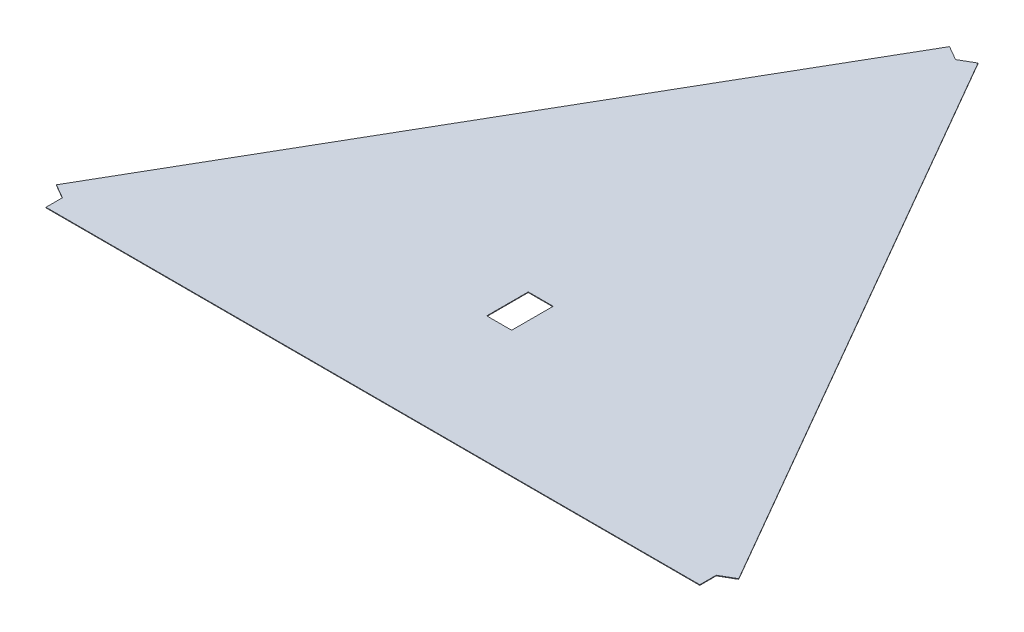
ISO-10303-21;
HEADER;
FILE_DESCRIPTION(('STEP AP214'),'2;1');
FILE_NAME('part.step','',(''),(''),'','','');
FILE_SCHEMA(('AUTOMOTIVE_DESIGN { 1 0 10303 214 1 1 1 1 }'));
ENDSEC;
DATA;
#1=APPLICATION_CONTEXT('core data for automotive mechanical design processes');
#2=APPLICATION_PROTOCOL_DEFINITION('international standard','automotive_design',2000,#1);
#3=PRODUCT_CONTEXT('',#1,'mechanical');
#4=PRODUCT('Part','Part','',(#3));
#5=PRODUCT_RELATED_PRODUCT_CATEGORY('part','',(#4));
#6=PRODUCT_DEFINITION_FORMATION('','',#4);
#7=PRODUCT_DEFINITION_CONTEXT('part definition',#1,'design');
#8=PRODUCT_DEFINITION('design','',#6,#7);
#9=PRODUCT_DEFINITION_SHAPE('','',#8);
#10=(LENGTH_UNIT() NAMED_UNIT(*) SI_UNIT(.MILLI.,.METRE.));
#11=(NAMED_UNIT(*) PLANE_ANGLE_UNIT() SI_UNIT($,.RADIAN.));
#12=(NAMED_UNIT(*) SI_UNIT($,.STERADIAN.) SOLID_ANGLE_UNIT());
#13=UNCERTAINTY_MEASURE_WITH_UNIT(LENGTH_MEASURE(1.E-05),#10,'distance_accuracy_value','');
#14=(GEOMETRIC_REPRESENTATION_CONTEXT(3) GLOBAL_UNCERTAINTY_ASSIGNED_CONTEXT((#13)) GLOBAL_UNIT_ASSIGNED_CONTEXT((#10,
#11,#12)) REPRESENTATION_CONTEXT('',''));
#15=CARTESIAN_POINT('',(0.,0.,0.));
#16=DIRECTION('',(0.,0.,1.));
#17=DIRECTION('',(1.,0.,0.));
#18=AXIS2_PLACEMENT_3D('',#15,#16,#17);
#19=CARTESIAN_POINT('',(3.08472954151232E-10,30035.2576446533,65120.5631891889));
#20=DIRECTION('',(0.,0.,-1.));
#21=DIRECTION('',(-1.,0.,0.));
#22=AXIS2_PLACEMENT_3D('',#19,#20,#21);
#23=PLANE('',#22);
#24=DIRECTION('',(1.,0.,0.));
#25=VECTOR('',#24,1.);
#26=CARTESIAN_POINT('',(3.08472954151232E-10,29965.2576446533,65120.5631891889));
#27=LINE('',#26,#25);
#28=CARTESIAN_POINT('',(47009.1129449273,29965.2576446533,65120.5631891887));
#29=VERTEX_POINT('',#28);
#30=CARTESIAN_POINT('',(50009.1129449273,29965.2576446533,65120.5631891887));
#31=VERTEX_POINT('',#30);
#32=EDGE_CURVE('E189',#29,#31,#27,.T.);
#33=ORIENTED_EDGE('',*,*,#32,.F.);
#34=DIRECTION('',(0.,-1.,0.));
#35=VECTOR('',#34,1.);
#36=CARTESIAN_POINT('',(47009.1129449273,30035.2576446533,65120.5631891887));
#37=LINE('',#36,#35);
#38=CARTESIAN_POINT('',(47009.1129449273,30035.2576446533,65120.5631891887));
#39=VERTEX_POINT('',#38);
#40=EDGE_CURVE('E11',#39,#29,#37,.T.);
#41=ORIENTED_EDGE('',*,*,#40,.F.);
#42=DIRECTION('',(1.,0.,0.));
#43=VECTOR('',#42,1.);
#44=CARTESIAN_POINT('',(3.08472954151232E-10,30035.2576446533,65120.5631891889));
#45=LINE('',#44,#43);
#46=CARTESIAN_POINT('',(50009.1129449273,30035.2576446533,65120.5631891887));
#47=VERTEX_POINT('',#46);
#48=EDGE_CURVE('E150',#39,#47,#45,.T.);
#49=ORIENTED_EDGE('',*,*,#48,.T.);
#50=DIRECTION('',(0.,-1.,0.));
#51=VECTOR('',#50,1.);
#52=CARTESIAN_POINT('',(50009.1129449273,30035.2576446533,65120.5631891887));
#53=LINE('',#52,#51);
#54=EDGE_CURVE('E54',#47,#31,#53,.T.);
#55=ORIENTED_EDGE('',*,*,#54,.T.);
#56=EDGE_LOOP('',(#33,#41,#49,#55));
#57=FACE_BOUND('',#56,.T.);
#58=ADVANCED_FACE('F35',(#57),#23,.T.);
#59=CARTESIAN_POINT('',(47009.1129449273,30035.2576446533,0.));
#60=DIRECTION('',(-1.,0.,0.));
#61=DIRECTION('',(0.,0.,1.));
#62=AXIS2_PLACEMENT_3D('',#59,#60,#61);
#63=PLANE('',#62);
#64=DIRECTION('',(0.,0.,-1.));
#65=VECTOR('',#64,1.);
#66=CARTESIAN_POINT('',(47009.1129449273,29965.2576446533,0.));
#67=LINE('',#66,#65);
#68=CARTESIAN_POINT('',(47009.1129449273,29965.2576446533,60120.5631891887));
#69=VERTEX_POINT('',#68);
#70=EDGE_CURVE('E155',#29,#69,#67,.T.);
#71=ORIENTED_EDGE('',*,*,#70,.T.);
#72=DIRECTION('',(0.,-1.,0.));
#73=VECTOR('',#72,1.);
#74=CARTESIAN_POINT('',(47009.1129449273,30035.2576446533,60120.5631891887));
#75=LINE('',#74,#73);
#76=CARTESIAN_POINT('',(47009.1129449273,30035.2576446533,60120.5631891887));
#77=VERTEX_POINT('',#76);
#78=EDGE_CURVE('E45',#77,#69,#75,.T.);
#79=ORIENTED_EDGE('',*,*,#78,.F.);
#80=DIRECTION('',(0.,0.,-1.));
#81=VECTOR('',#80,1.);
#82=CARTESIAN_POINT('',(47009.1129449273,30035.2576446533,0.));
#83=LINE('',#82,#81);
#84=EDGE_CURVE('E145',#39,#77,#83,.T.);
#85=ORIENTED_EDGE('',*,*,#84,.F.);
#86=ORIENTED_EDGE('',*,*,#40,.T.);
#87=EDGE_LOOP('',(#71,#79,#85,#86));
#88=FACE_BOUND('',#87,.T.);
#89=ADVANCED_FACE('F153',(#88),#63,.F.);
#90=CARTESIAN_POINT('',(0.,30035.2576446533,60120.5631891887));
#91=DIRECTION('',(0.,0.,-1.));
#92=DIRECTION('',(-1.,0.,0.));
#93=AXIS2_PLACEMENT_3D('',#90,#91,#92);
#94=PLANE('',#93);
#95=DIRECTION('',(1.,0.,0.));
#96=VECTOR('',#95,1.);
#97=CARTESIAN_POINT('',(0.,29965.2576446533,60120.5631891887));
#98=LINE('',#97,#96);
#99=CARTESIAN_POINT('',(50009.1129449273,29965.2576446533,60120.5631891887));
#100=VERTEX_POINT('',#99);
#101=EDGE_CURVE('E186',#69,#100,#98,.T.);
#102=ORIENTED_EDGE('',*,*,#101,.T.);
#103=DIRECTION('',(0.,-1.,0.));
#104=VECTOR('',#103,1.);
#105=CARTESIAN_POINT('',(50009.1129449273,30035.2576446533,60120.5631891887));
#106=LINE('',#105,#104);
#107=CARTESIAN_POINT('',(50009.1129449273,30035.2576446533,60120.5631891887));
#108=VERTEX_POINT('',#107);
#109=EDGE_CURVE('E95',#108,#100,#106,.T.);
#110=ORIENTED_EDGE('',*,*,#109,.F.);
#111=DIRECTION('',(1.,0.,0.));
#112=VECTOR('',#111,1.);
#113=CARTESIAN_POINT('',(0.,30035.2576446533,60120.5631891887));
#114=LINE('',#113,#112);
#115=EDGE_CURVE('E137',#77,#108,#114,.T.);
#116=ORIENTED_EDGE('',*,*,#115,.F.);
#117=ORIENTED_EDGE('',*,*,#78,.T.);
#118=EDGE_LOOP('',(#102,#110,#116,#117));
#119=FACE_BOUND('',#118,.T.);
#120=ADVANCED_FACE('F139',(#119),#94,.F.);
#121=CARTESIAN_POINT('',(16526.6845081917,30035.2576446533,28625.060606751));
#122=DIRECTION('',(-0.499999956010115,0.,-0.866025429182009));
#123=DIRECTION('',(-0.866025429182009,0.,0.499999956010115));
#124=AXIS2_PLACEMENT_3D('',#121,#122,#123);
#125=PLANE('',#124);
#126=DIRECTION('',(0.866025429182009,0.,-0.499999956010115));
#127=VECTOR('',#126,1.);
#128=CARTESIAN_POINT('',(16526.6845081917,29965.2576446533,28625.060606751));
#129=LINE('',#128,#127);
#130=CARTESIAN_POINT('',(48509.1133117676,29965.2576446533,10159.9988937378));
#131=VERTEX_POINT('',#130);
#132=CARTESIAN_POINT('',(50223.843661548,29965.2576446533,9169.99898083775));
#133=VERTEX_POINT('',#132);
#134=EDGE_CURVE('E214',#131,#133,#129,.T.);
#135=ORIENTED_EDGE('',*,*,#134,.F.);
#136=DIRECTION('',(0.,-1.,0.));
#137=VECTOR('',#136,1.);
#138=CARTESIAN_POINT('',(48509.1133117676,30035.2576446533,10159.9988937378));
#139=LINE('',#138,#137);
#140=CARTESIAN_POINT('',(48509.1133117676,30035.2576446533,10159.9988937378));
#141=VERTEX_POINT('',#140);
#142=EDGE_CURVE('E39',#141,#131,#139,.T.);
#143=ORIENTED_EDGE('',*,*,#142,.F.);
#144=DIRECTION('',(0.866025429182009,0.,-0.499999956010115));
#145=VECTOR('',#144,1.);
#146=CARTESIAN_POINT('',(16526.6845081917,30035.2576446533,28625.060606751));
#147=LINE('',#146,#145);
#148=CARTESIAN_POINT('',(50223.843661548,30035.2576446533,9169.99898083775));
#149=VERTEX_POINT('',#148);
#150=EDGE_CURVE('E185',#141,#149,#147,.T.);
#151=ORIENTED_EDGE('',*,*,#150,.T.);
#152=DIRECTION('',(0.,-1.,0.));
#153=VECTOR('',#152,1.);
#154=CARTESIAN_POINT('',(50223.843661548,30035.2576446533,9169.99898083775));
#155=LINE('',#154,#153);
#156=EDGE_CURVE('E160',#149,#133,#155,.T.);
#157=ORIENTED_EDGE('',*,*,#156,.T.);
#158=EDGE_LOOP('',(#135,#143,#151,#157));
#159=FACE_BOUND('',#158,.T.);
#160=ADVANCED_FACE('F37',(#159),#125,.T.);
#161=CARTESIAN_POINT('',(7727.8682672328,30035.2576446533,-13385.0617189679));
#162=DIRECTION('',(-0.499999965093882,0.,0.866025423937494));
#163=DIRECTION('',(0.866025423937495,0.,0.499999965093882));
#164=AXIS2_PLACEMENT_3D('',#161,#162,#163);
#165=PLANE('',#164);
#166=DIRECTION('',(-0.866025423937495,0.,-0.499999965093882));
#167=VECTOR('',#166,1.);
#168=CARTESIAN_POINT('',(7727.8682672328,29965.2576446533,-13385.0617189679));
#169=LINE('',#168,#167);
#170=CARTESIAN_POINT('',(46794.3829723713,29965.2576446533,9169.99896285191));
#171=VERTEX_POINT('',#170);
#172=EDGE_CURVE('E212',#131,#171,#169,.T.);
#173=ORIENTED_EDGE('',*,*,#172,.T.);
#174=DIRECTION('',(0.,-1.,0.));
#175=VECTOR('',#174,1.);
#176=CARTESIAN_POINT('',(46794.3829723713,30035.2576446533,9169.99896285191));
#177=LINE('',#176,#175);
#178=CARTESIAN_POINT('',(46794.3829723713,30035.2576446533,9169.99896285191));
#179=VERTEX_POINT('',#178);
#180=EDGE_CURVE('E173',#179,#171,#177,.T.);
#181=ORIENTED_EDGE('',*,*,#180,.F.);
#182=DIRECTION('',(-0.866025423937495,0.,-0.499999965093882));
#183=VECTOR('',#182,1.);
#184=CARTESIAN_POINT('',(7727.8682672328,30035.2576446533,-13385.0617189679));
#185=LINE('',#184,#183);
#186=EDGE_CURVE('E237',#141,#179,#185,.T.);
#187=ORIENTED_EDGE('',*,*,#186,.F.);
#188=ORIENTED_EDGE('',*,*,#142,.T.);
#189=EDGE_LOOP('',(#173,#181,#187,#188));
#190=FACE_BOUND('',#189,.T.);
#191=ADVANCED_FACE('F253',(#190),#165,.F.);
#192=CARTESIAN_POINT('',(39066.5147051385,30035.2576446533,22555.0606818198));
#193=DIRECTION('',(-0.866025423937494,0.,-0.499999965093882));
#194=DIRECTION('',(-0.499999965093882,0.,0.866025423937494));
#195=AXIS2_PLACEMENT_3D('',#192,#193,#194);
#196=PLANE('',#195);
#197=DIRECTION('',(0.499999965093882,0.,-0.866025423937494));
#198=VECTOR('',#197,1.);
#199=CARTESIAN_POINT('',(39066.5147051385,29965.2576446533,22555.0606818198));
#200=LINE('',#199,#198);
#201=CARTESIAN_POINT('',(7424.38308681225,29965.2576446533,77360.8454060282));
#202=VERTEX_POINT('',#201);
#203=EDGE_CURVE('E209',#202,#171,#200,.T.);
#204=ORIENTED_EDGE('',*,*,#203,.F.);
#205=DIRECTION('',(0.,-1.,0.));
#206=VECTOR('',#205,1.);
#207=CARTESIAN_POINT('',(7424.38308681225,30035.2576446533,77360.8454060282));
#208=LINE('',#207,#206);
#209=CARTESIAN_POINT('',(7424.38308681225,30035.2576446533,77360.8454060282));
#210=VERTEX_POINT('',#209);
#211=EDGE_CURVE('E172',#210,#202,#208,.T.);
#212=ORIENTED_EDGE('',*,*,#211,.F.);
#213=DIRECTION('',(0.499999965093882,0.,-0.866025423937494));
#214=VECTOR('',#213,1.);
#215=CARTESIAN_POINT('',(39066.5147051385,30035.2576446533,22555.0606818198));
#216=LINE('',#215,#214);
#217=EDGE_CURVE('E235',#210,#179,#216,.T.);
#218=ORIENTED_EDGE('',*,*,#217,.T.);
#219=ORIENTED_EDGE('',*,*,#180,.T.);
#220=EDGE_LOOP('',(#204,#212,#218,#219));
#221=FACE_BOUND('',#220,.T.);
#222=ADVANCED_FACE('F255',(#221),#196,.T.);
#223=CARTESIAN_POINT('',(-31642.1316183263,30035.2576446533,54805.7847242084));
#224=DIRECTION('',(-0.499999965093882,0.,0.866025423937494));
#225=DIRECTION('',(0.866025423937495,0.,0.499999965093882));
#226=AXIS2_PLACEMENT_3D('',#223,#224,#225);
#227=PLANE('',#226);
#228=DIRECTION('',(-0.866025423937495,0.,-0.499999965093882));
#229=VECTOR('',#228,1.);
#230=CARTESIAN_POINT('',(-31642.1316183263,29965.2576446533,54805.7847242084));
#231=LINE('',#230,#229);
#232=CARTESIAN_POINT('',(9139.1134262085,29965.2576446533,78350.8453369141));
#233=VERTEX_POINT('',#232);
#234=EDGE_CURVE('E206',#233,#202,#231,.T.);
#235=ORIENTED_EDGE('',*,*,#234,.F.);
#236=DIRECTION('',(0.,-1.,0.));
#237=VECTOR('',#236,1.);
#238=CARTESIAN_POINT('',(9139.1134262085,30035.2576446533,78350.8453369141));
#239=LINE('',#238,#237);
#240=CARTESIAN_POINT('',(9139.1134262085,30035.2576446533,78350.8453369141));
#241=VERTEX_POINT('',#240);
#242=EDGE_CURVE('E170',#241,#233,#239,.T.);
#243=ORIENTED_EDGE('',*,*,#242,.F.);
#244=DIRECTION('',(-0.866025423937495,0.,-0.499999965093882));
#245=VECTOR('',#244,1.);
#246=CARTESIAN_POINT('',(-31642.1316183263,30035.2576446533,54805.7847242084));
#247=LINE('',#246,#245);
#248=EDGE_CURVE('E232',#241,#210,#247,.T.);
#249=ORIENTED_EDGE('',*,*,#248,.T.);
#250=ORIENTED_EDGE('',*,*,#211,.T.);
#251=EDGE_LOOP('',(#235,#243,#249,#250));
#252=FACE_BOUND('',#251,.T.);
#253=ADVANCED_FACE('F259',(#252),#227,.T.);
#254=CARTESIAN_POINT('',(9139.1134262085,30035.2576446533,0.));
#255=DIRECTION('',(1.,0.,0.));
#256=DIRECTION('',(0.,0.,-1.));
#257=AXIS2_PLACEMENT_3D('',#254,#255,#256);
#258=PLANE('',#257);
#259=DIRECTION('',(0.,0.,1.));
#260=VECTOR('',#259,1.);
#261=CARTESIAN_POINT('',(9139.1134262085,29965.2576446533,0.));
#262=LINE('',#261,#260);
#263=CARTESIAN_POINT('',(9139.1134262085,29965.2576446533,80330.8453369141));
#264=VERTEX_POINT('',#263);
#265=EDGE_CURVE('E203',#233,#264,#262,.T.);
#266=ORIENTED_EDGE('',*,*,#265,.T.);
#267=DIRECTION('',(0.,-1.,0.));
#268=VECTOR('',#267,1.);
#269=CARTESIAN_POINT('',(9139.1134262085,30035.2576446533,80330.8453369141));
#270=LINE('',#269,#268);
#271=CARTESIAN_POINT('',(9139.1134262085,30035.2576446533,80330.8453369141));
#272=VERTEX_POINT('',#271);
#273=EDGE_CURVE('E168',#272,#264,#270,.T.);
#274=ORIENTED_EDGE('',*,*,#273,.F.);
#275=DIRECTION('',(0.,0.,1.));
#276=VECTOR('',#275,1.);
#277=CARTESIAN_POINT('',(9139.1134262085,30035.2576446533,0.));
#278=LINE('',#277,#276);
#279=EDGE_CURVE('E230',#241,#272,#278,.T.);
#280=ORIENTED_EDGE('',*,*,#279,.F.);
#281=ORIENTED_EDGE('',*,*,#242,.T.);
#282=EDGE_LOOP('',(#266,#274,#280,#281));
#283=FACE_BOUND('',#282,.T.);
#284=ADVANCED_FACE('F264',(#283),#258,.F.);
#285=CARTESIAN_POINT('',(0.,30035.2576446533,80330.8453369141));
#286=DIRECTION('',(0.,0.,1.));
#287=DIRECTION('',(1.,0.,0.));
#288=AXIS2_PLACEMENT_3D('',#285,#286,#287);
#289=PLANE('',#288);
#290=DIRECTION('',(-1.,0.,0.));
#291=VECTOR('',#290,1.);
#292=CARTESIAN_POINT('',(0.,29965.2576446533,80330.8453369141));
#293=LINE('',#292,#291);
#294=CARTESIAN_POINT('',(87879.1122436523,29965.2576446533,80330.8453369141));
#295=VERTEX_POINT('',#294);
#296=EDGE_CURVE('E200',#295,#264,#293,.T.);
#297=ORIENTED_EDGE('',*,*,#296,.F.);
#298=DIRECTION('',(0.,-1.,0.));
#299=VECTOR('',#298,1.);
#300=CARTESIAN_POINT('',(87879.1122436523,30035.2576446533,80330.8453369141));
#301=LINE('',#300,#299);
#302=CARTESIAN_POINT('',(87879.1122436523,30035.2576446533,80330.8453369141));
#303=VERTEX_POINT('',#302);
#304=EDGE_CURVE('E166',#303,#295,#301,.T.);
#305=ORIENTED_EDGE('',*,*,#304,.F.);
#306=DIRECTION('',(-1.,0.,0.));
#307=VECTOR('',#306,1.);
#308=CARTESIAN_POINT('',(0.,30035.2576446533,80330.8453369141));
#309=LINE('',#308,#307);
#310=EDGE_CURVE('E227',#303,#272,#309,.T.);
#311=ORIENTED_EDGE('',*,*,#310,.T.);
#312=ORIENTED_EDGE('',*,*,#273,.T.);
#313=EDGE_LOOP('',(#297,#305,#311,#312));
#314=FACE_BOUND('',#313,.T.);
#315=ADVANCED_FACE('F280',(#314),#289,.T.);
#316=CARTESIAN_POINT('',(87879.1122436523,30035.2576446533,0.));
#317=DIRECTION('',(1.,0.,0.));
#318=DIRECTION('',(0.,0.,-1.));
#319=AXIS2_PLACEMENT_3D('',#316,#317,#318);
#320=PLANE('',#319);
#321=DIRECTION('',(0.,0.,1.));
#322=VECTOR('',#321,1.);
#323=CARTESIAN_POINT('',(87879.1122436523,29965.2576446533,0.));
#324=LINE('',#323,#322);
#325=CARTESIAN_POINT('',(87879.1122436523,29965.2576446533,78350.8453369141));
#326=VERTEX_POINT('',#325);
#327=EDGE_CURVE('E197',#326,#295,#324,.T.);
#328=ORIENTED_EDGE('',*,*,#327,.F.);
#329=DIRECTION('',(0.,-1.,0.));
#330=VECTOR('',#329,1.);
#331=CARTESIAN_POINT('',(87879.1122436523,30035.2576446533,78350.8453369141));
#332=LINE('',#331,#330);
#333=CARTESIAN_POINT('',(87879.1122436523,30035.2576446533,78350.8453369141));
#334=VERTEX_POINT('',#333);
#335=EDGE_CURVE('E164',#334,#326,#332,.T.);
#336=ORIENTED_EDGE('',*,*,#335,.F.);
#337=DIRECTION('',(0.,0.,1.));
#338=VECTOR('',#337,1.);
#339=CARTESIAN_POINT('',(87879.1122436523,30035.2576446533,0.));
#340=LINE('',#339,#338);
#341=EDGE_CURVE('E224',#334,#303,#340,.T.);
#342=ORIENTED_EDGE('',*,*,#341,.T.);
#343=ORIENTED_EDGE('',*,*,#304,.T.);
#344=EDGE_LOOP('',(#328,#336,#342,#343));
#345=FACE_BOUND('',#344,.T.);
#346=ADVANCED_FACE('F268',(#345),#320,.T.);
#347=CARTESIAN_POINT('',(55896.6834400758,30035.2576446533,96815.9070499275));
#348=DIRECTION('',(-0.49999995601011,0.,-0.866025429182012));
#349=DIRECTION('',(-0.866025429182012,0.,0.49999995601011));
#350=AXIS2_PLACEMENT_3D('',#347,#348,#349);
#351=PLANE('',#350);
#352=DIRECTION('',(0.866025429182012,0.,-0.49999995601011));
#353=VECTOR('',#352,1.);
#354=CARTESIAN_POINT('',(55896.6834400758,29965.2576446533,96815.9070499275));
#355=LINE('',#354,#353);
#356=CARTESIAN_POINT('',(89593.8425934327,29965.2576446533,77360.845424014));
#357=VERTEX_POINT('',#356);
#358=EDGE_CURVE('E194',#326,#357,#355,.T.);
#359=ORIENTED_EDGE('',*,*,#358,.T.);
#360=DIRECTION('',(0.,-1.,0.));
#361=VECTOR('',#360,1.);
#362=CARTESIAN_POINT('',(89593.8425934327,30035.2576446533,77360.845424014));
#363=LINE('',#362,#361);
#364=CARTESIAN_POINT('',(89593.8425934327,30035.2576446533,77360.845424014));
#365=VERTEX_POINT('',#364);
#366=EDGE_CURVE('E162',#365,#357,#363,.T.);
#367=ORIENTED_EDGE('',*,*,#366,.F.);
#368=DIRECTION('',(0.866025429182012,0.,-0.49999995601011));
#369=VECTOR('',#368,1.);
#370=CARTESIAN_POINT('',(55896.6834400758,30035.2576446533,96815.9070499275));
#371=LINE('',#370,#369);
#372=EDGE_CURVE('E222',#334,#365,#371,.T.);
#373=ORIENTED_EDGE('',*,*,#372,.F.);
#374=ORIENTED_EDGE('',*,*,#335,.T.);
#375=EDGE_LOOP('',(#359,#367,#373,#374));
#376=FACE_BOUND('',#375,.T.);
#377=ADVANCED_FACE('F271',(#376),#351,.F.);
#378=CARTESIAN_POINT('',(33697.1591533562,30035.2576446533,-19455.0616259133));
#379=DIRECTION('',(0.866025429182009,0.,-0.499999956010116));
#380=DIRECTION('',(-0.499999956010116,0.,-0.866025429182009));
#381=AXIS2_PLACEMENT_3D('',#378,#379,#380);
#382=PLANE('',#381);
#383=DIRECTION('',(0.499999956010116,0.,0.866025429182009));
#384=VECTOR('',#383,1.);
#385=CARTESIAN_POINT('',(33697.1591533562,29965.2576446533,-19455.0616259133));
#386=LINE('',#385,#384);
#387=EDGE_CURVE('E191',#133,#357,#386,.T.);
#388=ORIENTED_EDGE('',*,*,#387,.F.);
#389=ORIENTED_EDGE('',*,*,#156,.F.);
#390=DIRECTION('',(0.499999956010116,0.,0.866025429182009));
#391=VECTOR('',#390,1.);
#392=CARTESIAN_POINT('',(33697.1591533562,30035.2576446533,-19455.0616259133));
#393=LINE('',#392,#391);
#394=EDGE_CURVE('E219',#149,#365,#393,.T.);
#395=ORIENTED_EDGE('',*,*,#394,.T.);
#396=ORIENTED_EDGE('',*,*,#366,.T.);
#397=EDGE_LOOP('',(#388,#389,#395,#396));
#398=FACE_BOUND('',#397,.T.);
#399=ADVANCED_FACE('F247',(#398),#382,.T.);
#400=CARTESIAN_POINT('',(50009.1129449274,30035.2576446533,7.10672238496492E-11));
#401=DIRECTION('',(-1.,0.,0.));
#402=DIRECTION('',(0.,0.,1.));
#403=AXIS2_PLACEMENT_3D('',#400,#401,#402);
#404=PLANE('',#403);
#405=DIRECTION('',(0.,0.,-1.));
#406=VECTOR('',#405,1.);
#407=CARTESIAN_POINT('',(50009.1129449274,29965.2576446533,7.10672238496492E-11));
#408=LINE('',#407,#406);
#409=EDGE_CURVE('E182',#31,#100,#408,.T.);
#410=ORIENTED_EDGE('',*,*,#409,.F.);
#411=ORIENTED_EDGE('',*,*,#54,.F.);
#412=DIRECTION('',(0.,0.,-1.));
#413=VECTOR('',#412,1.);
#414=CARTESIAN_POINT('',(50009.1129449274,30035.2576446533,7.10672238496492E-11));
#415=LINE('',#414,#413);
#416=EDGE_CURVE('E144',#47,#108,#415,.T.);
#417=ORIENTED_EDGE('',*,*,#416,.T.);
#418=ORIENTED_EDGE('',*,*,#109,.T.);
#419=EDGE_LOOP('',(#410,#411,#417,#418));
#420=FACE_BOUND('',#419,.T.);
#421=ADVANCED_FACE('F278',(#420),#404,.T.);
#422=CARTESIAN_POINT('',(0.,30035.2576446533,0.));
#423=DIRECTION('',(0.,1.,0.));
#424=DIRECTION('',(0.,0.,1.));
#425=AXIS2_PLACEMENT_3D('',#422,#423,#424);
#426=PLANE('',#425);
#427=ORIENTED_EDGE('',*,*,#150,.F.);
#428=ORIENTED_EDGE('',*,*,#186,.T.);
#429=ORIENTED_EDGE('',*,*,#217,.F.);
#430=ORIENTED_EDGE('',*,*,#248,.F.);
#431=ORIENTED_EDGE('',*,*,#279,.T.);
#432=ORIENTED_EDGE('',*,*,#310,.F.);
#433=ORIENTED_EDGE('',*,*,#341,.F.);
#434=ORIENTED_EDGE('',*,*,#372,.T.);
#435=ORIENTED_EDGE('',*,*,#394,.F.);
#436=EDGE_LOOP('',(#427,#428,#429,#430,#431,#432,#433,#434,#435));
#437=FACE_BOUND('',#436,.T.);
#438=ORIENTED_EDGE('',*,*,#48,.F.);
#439=ORIENTED_EDGE('',*,*,#84,.T.);
#440=ORIENTED_EDGE('',*,*,#115,.T.);
#441=ORIENTED_EDGE('',*,*,#416,.F.);
#442=EDGE_LOOP('',(#438,#439,#440,#441));
#443=FACE_BOUND('',#442,.T.);
#444=ADVANCED_FACE('F149',(#437,#443),#426,.T.);
#445=CARTESIAN_POINT('',(0.,29965.2576446533,0.));
#446=DIRECTION('',(0.,1.,0.));
#447=DIRECTION('',(0.,0.,1.));
#448=AXIS2_PLACEMENT_3D('',#445,#446,#447);
#449=PLANE('',#448);
#450=ORIENTED_EDGE('',*,*,#134,.T.);
#451=ORIENTED_EDGE('',*,*,#387,.T.);
#452=ORIENTED_EDGE('',*,*,#358,.F.);
#453=ORIENTED_EDGE('',*,*,#327,.T.);
#454=ORIENTED_EDGE('',*,*,#296,.T.);
#455=ORIENTED_EDGE('',*,*,#265,.F.);
#456=ORIENTED_EDGE('',*,*,#234,.T.);
#457=ORIENTED_EDGE('',*,*,#203,.T.);
#458=ORIENTED_EDGE('',*,*,#172,.F.);
#459=EDGE_LOOP('',(#450,#451,#452,#453,#454,#455,#456,#457,#458));
#460=FACE_BOUND('',#459,.T.);
#461=ORIENTED_EDGE('',*,*,#32,.T.);
#462=ORIENTED_EDGE('',*,*,#409,.T.);
#463=ORIENTED_EDGE('',*,*,#101,.F.);
#464=ORIENTED_EDGE('',*,*,#70,.F.);
#465=EDGE_LOOP('',(#461,#462,#463,#464));
#466=FACE_BOUND('',#465,.T.);
#467=ADVANCED_FACE('F250',(#460,#466),#449,.F.);
#468=CLOSED_SHELL('',(#58,#89,#120,#160,#191,#222,#253,#284,#315,#346,#377,#399,#421,#444,#467));
#469=MANIFOLD_SOLID_BREP('B2',#468);
#470=ADVANCED_BREP_SHAPE_REPRESENTATION('',(#18,#469),#14);
#471=SHAPE_DEFINITION_REPRESENTATION(#9,#470);
ENDSEC;
END-ISO-10303-21;
